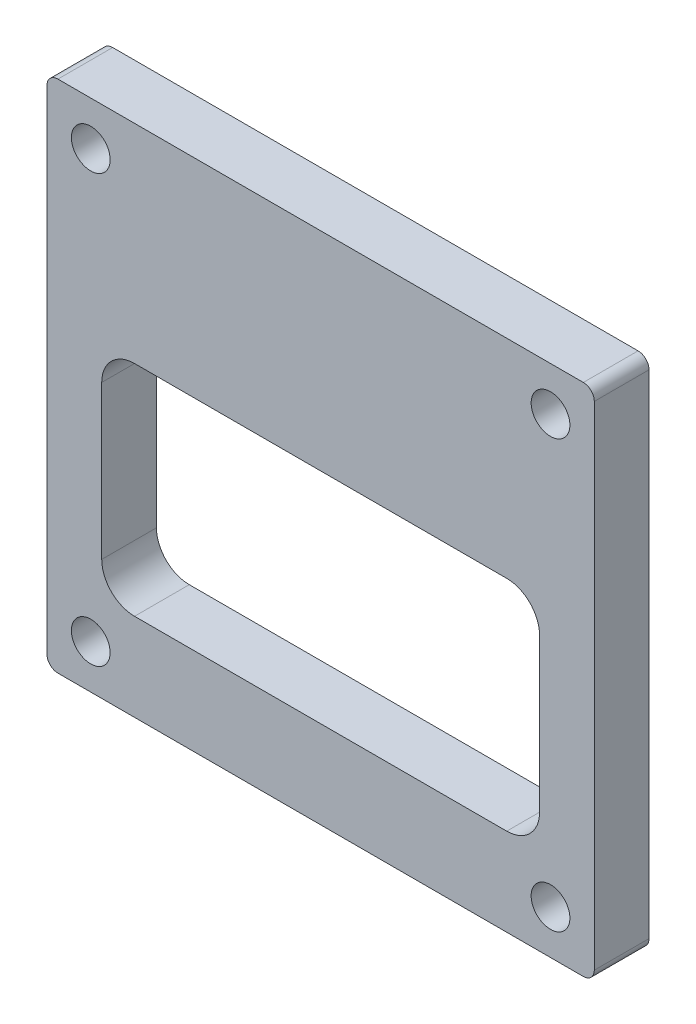
ISO-10303-21;
HEADER;
FILE_DESCRIPTION(('STEP AP214'),'2;1');
FILE_NAME('part.step','',(''),(''),'','','');
FILE_SCHEMA(('AUTOMOTIVE_DESIGN { 1 0 10303 214 1 1 1 1 }'));
ENDSEC;
DATA;
#1=APPLICATION_CONTEXT('core data for automotive mechanical design processes');
#2=APPLICATION_PROTOCOL_DEFINITION('international standard','automotive_design',2000,#1);
#3=PRODUCT_CONTEXT('',#1,'mechanical');
#4=PRODUCT('Part','Part','',(#3));
#5=PRODUCT_RELATED_PRODUCT_CATEGORY('part','',(#4));
#6=PRODUCT_DEFINITION_FORMATION('','',#4);
#7=PRODUCT_DEFINITION_CONTEXT('part definition',#1,'design');
#8=PRODUCT_DEFINITION('design','',#6,#7);
#9=PRODUCT_DEFINITION_SHAPE('','',#8);
#10=(LENGTH_UNIT() NAMED_UNIT(*) SI_UNIT(.MILLI.,.METRE.));
#11=(NAMED_UNIT(*) PLANE_ANGLE_UNIT() SI_UNIT($,.RADIAN.));
#12=(NAMED_UNIT(*) SI_UNIT($,.STERADIAN.) SOLID_ANGLE_UNIT());
#13=UNCERTAINTY_MEASURE_WITH_UNIT(LENGTH_MEASURE(1.E-05),#10,'distance_accuracy_value','');
#14=(GEOMETRIC_REPRESENTATION_CONTEXT(3) GLOBAL_UNCERTAINTY_ASSIGNED_CONTEXT((#13)) GLOBAL_UNIT_ASSIGNED_CONTEXT((#10,
#11,#12)) REPRESENTATION_CONTEXT('',''));
#15=CARTESIAN_POINT('',(0.,0.,0.));
#16=DIRECTION('',(0.,0.,1.));
#17=DIRECTION('',(1.,0.,0.));
#18=AXIS2_PLACEMENT_3D('',#15,#16,#17);
#19=CARTESIAN_POINT('',(0.,0.,6.35));
#20=DIRECTION('',(1.,0.,0.));
#21=DIRECTION('',(0.,0.,-1.));
#22=AXIS2_PLACEMENT_3D('',#19,#20,#21);
#23=PLANE('',#22);
#24=DIRECTION('',(0.,-1.,0.));
#25=VECTOR('',#24,1.);
#26=CARTESIAN_POINT('',(0.,0.,0.));
#27=LINE('',#26,#25);
#28=CARTESIAN_POINT('',(0.,58.42,0.));
#29=VERTEX_POINT('',#28);
#30=CARTESIAN_POINT('',(0.,1.27,0.));
#31=VERTEX_POINT('',#30);
#32=EDGE_CURVE('E174',#29,#31,#27,.T.);
#33=ORIENTED_EDGE('',*,*,#32,.T.);
#34=DIRECTION('',(0.,0.,-1.));
#35=VECTOR('',#34,1.);
#36=CARTESIAN_POINT('',(0.,1.27,6.35));
#37=LINE('',#36,#35);
#38=CARTESIAN_POINT('',(0.,1.27,6.35));
#39=VERTEX_POINT('',#38);
#40=EDGE_CURVE('E152',#31,#39,#37,.F.);
#41=ORIENTED_EDGE('',*,*,#40,.T.);
#42=DIRECTION('',(0.,-1.,0.));
#43=VECTOR('',#42,1.);
#44=CARTESIAN_POINT('',(0.,0.,6.35));
#45=LINE('',#44,#43);
#46=CARTESIAN_POINT('',(0.,58.42,6.35));
#47=VERTEX_POINT('',#46);
#48=EDGE_CURVE('E185',#47,#39,#45,.T.);
#49=ORIENTED_EDGE('',*,*,#48,.F.);
#50=DIRECTION('',(0.,0.,-1.));
#51=VECTOR('',#50,1.);
#52=CARTESIAN_POINT('',(0.,58.42,6.35));
#53=LINE('',#52,#51);
#54=EDGE_CURVE('E157',#47,#29,#53,.T.);
#55=ORIENTED_EDGE('',*,*,#54,.T.);
#56=EDGE_LOOP('',(#33,#41,#49,#55));
#57=FACE_BOUND('',#56,.T.);
#58=ADVANCED_FACE('F34',(#57),#23,.F.);
#59=CARTESIAN_POINT('',(0.,0.,6.35));
#60=DIRECTION('',(0.,1.,0.));
#61=DIRECTION('',(0.,0.,1.));
#62=AXIS2_PLACEMENT_3D('',#59,#60,#61);
#63=PLANE('',#62);
#64=DIRECTION('',(1.,0.,0.));
#65=VECTOR('',#64,1.);
#66=CARTESIAN_POINT('',(0.,0.,6.35));
#67=LINE('',#66,#65);
#68=CARTESIAN_POINT('',(1.27,0.,6.35));
#69=VERTEX_POINT('',#68);
#70=CARTESIAN_POINT('',(62.23,0.,6.35));
#71=VERTEX_POINT('',#70);
#72=EDGE_CURVE('E167',#69,#71,#67,.T.);
#73=ORIENTED_EDGE('',*,*,#72,.F.);
#74=DIRECTION('',(0.,0.,-1.));
#75=VECTOR('',#74,1.);
#76=CARTESIAN_POINT('',(1.27,0.,6.35));
#77=LINE('',#76,#75);
#78=CARTESIAN_POINT('',(1.27,0.,0.));
#79=VERTEX_POINT('',#78);
#80=EDGE_CURVE('E151',#69,#79,#77,.T.);
#81=ORIENTED_EDGE('',*,*,#80,.T.);
#82=DIRECTION('',(1.,0.,0.));
#83=VECTOR('',#82,1.);
#84=CARTESIAN_POINT('',(0.,0.,0.));
#85=LINE('',#84,#83);
#86=CARTESIAN_POINT('',(62.23,0.,0.));
#87=VERTEX_POINT('',#86);
#88=EDGE_CURVE('E164',#79,#87,#85,.T.);
#89=ORIENTED_EDGE('',*,*,#88,.T.);
#90=DIRECTION('',(0.,0.,-1.));
#91=VECTOR('',#90,1.);
#92=CARTESIAN_POINT('',(62.23,0.,6.35));
#93=LINE('',#92,#91);
#94=EDGE_CURVE('E169',#87,#71,#93,.F.);
#95=ORIENTED_EDGE('',*,*,#94,.T.);
#96=EDGE_LOOP('',(#73,#81,#89,#95));
#97=FACE_BOUND('',#96,.T.);
#98=ADVANCED_FACE('F163',(#97),#63,.F.);
#99=CARTESIAN_POINT('',(63.5,0.,6.35));
#100=DIRECTION('',(-1.,0.,0.));
#101=DIRECTION('',(0.,0.,1.));
#102=AXIS2_PLACEMENT_3D('',#99,#100,#101);
#103=PLANE('',#102);
#104=DIRECTION('',(0.,1.,0.));
#105=VECTOR('',#104,1.);
#106=CARTESIAN_POINT('',(63.5,0.,6.35));
#107=LINE('',#106,#105);
#108=CARTESIAN_POINT('',(63.5,1.27,6.35));
#109=VERTEX_POINT('',#108);
#110=CARTESIAN_POINT('',(63.5,58.42,6.35));
#111=VERTEX_POINT('',#110);
#112=EDGE_CURVE('E306',#109,#111,#107,.T.);
#113=ORIENTED_EDGE('',*,*,#112,.F.);
#114=DIRECTION('',(0.,0.,-1.));
#115=VECTOR('',#114,1.);
#116=CARTESIAN_POINT('',(63.5,1.27,6.35));
#117=LINE('',#116,#115);
#118=CARTESIAN_POINT('',(63.5,1.27,0.));
#119=VERTEX_POINT('',#118);
#120=EDGE_CURVE('E205',#109,#119,#117,.T.);
#121=ORIENTED_EDGE('',*,*,#120,.T.);
#122=DIRECTION('',(0.,1.,0.));
#123=VECTOR('',#122,1.);
#124=CARTESIAN_POINT('',(63.5,0.,0.));
#125=LINE('',#124,#123);
#126=CARTESIAN_POINT('',(63.5,58.42,0.));
#127=VERTEX_POINT('',#126);
#128=EDGE_CURVE('E173',#119,#127,#125,.T.);
#129=ORIENTED_EDGE('',*,*,#128,.T.);
#130=DIRECTION('',(0.,0.,-1.));
#131=VECTOR('',#130,1.);
#132=CARTESIAN_POINT('',(63.5,58.42,6.35));
#133=LINE('',#132,#131);
#134=EDGE_CURVE('E203',#127,#111,#133,.F.);
#135=ORIENTED_EDGE('',*,*,#134,.T.);
#136=EDGE_LOOP('',(#113,#121,#129,#135));
#137=FACE_BOUND('',#136,.T.);
#138=ADVANCED_FACE('F328',(#137),#103,.F.);
#139=CARTESIAN_POINT('',(0.,59.69,6.35));
#140=DIRECTION('',(0.,-1.,0.));
#141=DIRECTION('',(0.,0.,-1.));
#142=AXIS2_PLACEMENT_3D('',#139,#140,#141);
#143=PLANE('',#142);
#144=DIRECTION('',(-1.,0.,0.));
#145=VECTOR('',#144,1.);
#146=CARTESIAN_POINT('',(0.,59.69,6.35));
#147=LINE('',#146,#145);
#148=CARTESIAN_POINT('',(62.23,59.69,6.35));
#149=VERTEX_POINT('',#148);
#150=CARTESIAN_POINT('',(1.27,59.69,6.35));
#151=VERTEX_POINT('',#150);
#152=EDGE_CURVE('E186',#149,#151,#147,.T.);
#153=ORIENTED_EDGE('',*,*,#152,.F.);
#154=DIRECTION('',(0.,0.,-1.));
#155=VECTOR('',#154,1.);
#156=CARTESIAN_POINT('',(62.23,59.69,6.35));
#157=LINE('',#156,#155);
#158=CARTESIAN_POINT('',(62.23,59.69,0.));
#159=VERTEX_POINT('',#158);
#160=EDGE_CURVE('E210',#149,#159,#157,.T.);
#161=ORIENTED_EDGE('',*,*,#160,.T.);
#162=DIRECTION('',(-1.,0.,0.));
#163=VECTOR('',#162,1.);
#164=CARTESIAN_POINT('',(0.,59.69,0.));
#165=LINE('',#164,#163);
#166=CARTESIAN_POINT('',(1.27,59.69,0.));
#167=VERTEX_POINT('',#166);
#168=EDGE_CURVE('E177',#159,#167,#165,.T.);
#169=ORIENTED_EDGE('',*,*,#168,.T.);
#170=DIRECTION('',(0.,0.,-1.));
#171=VECTOR('',#170,1.);
#172=CARTESIAN_POINT('',(1.27,59.69,6.35));
#173=LINE('',#172,#171);
#174=EDGE_CURVE('E208',#167,#151,#173,.F.);
#175=ORIENTED_EDGE('',*,*,#174,.T.);
#176=EDGE_LOOP('',(#153,#161,#169,#175));
#177=FACE_BOUND('',#176,.T.);
#178=ADVANCED_FACE('F322',(#177),#143,.F.);
#179=CARTESIAN_POINT('',(0.,0.,6.35));
#180=DIRECTION('',(0.,0.,-1.));
#181=DIRECTION('',(-1.,0.,0.));
#182=AXIS2_PLACEMENT_3D('',#179,#180,#181);
#183=PLANE('',#182);
#184=DIRECTION('',(1.,0.,0.));
#185=VECTOR('',#184,1.);
#186=CARTESIAN_POINT('',(6.35,10.16,6.35));
#187=LINE('',#186,#185);
#188=CARTESIAN_POINT('',(10.16,10.16,6.35));
#189=VERTEX_POINT('',#188);
#190=CARTESIAN_POINT('',(53.34,10.16,6.35));
#191=VERTEX_POINT('',#190);
#192=EDGE_CURVE('E276',#189,#191,#187,.T.);
#193=ORIENTED_EDGE('',*,*,#192,.F.);
#194=CARTESIAN_POINT('',(10.16,13.97,6.35));
#195=DIRECTION('',(0.,0.,-1.));
#196=DIRECTION('',(-1.,0.,0.));
#197=AXIS2_PLACEMENT_3D('',#194,#195,#196);
#198=CIRCLE('',#197,3.81);
#199=CARTESIAN_POINT('',(6.35,13.97,6.35));
#200=VERTEX_POINT('',#199);
#201=EDGE_CURVE('E240',#189,#200,#198,.T.);
#202=ORIENTED_EDGE('',*,*,#201,.T.);
#203=DIRECTION('',(0.,-1.,0.));
#204=VECTOR('',#203,1.);
#205=CARTESIAN_POINT('',(6.35,35.56,6.35));
#206=LINE('',#205,#204);
#207=CARTESIAN_POINT('',(6.35,31.75,6.35));
#208=VERTEX_POINT('',#207);
#209=EDGE_CURVE('E251',#208,#200,#206,.T.);
#210=ORIENTED_EDGE('',*,*,#209,.F.);
#211=CARTESIAN_POINT('',(10.16,31.75,6.35));
#212=DIRECTION('',(0.,0.,-1.));
#213=DIRECTION('',(-1.,0.,0.));
#214=AXIS2_PLACEMENT_3D('',#211,#212,#213);
#215=CIRCLE('',#214,3.81);
#216=CARTESIAN_POINT('',(10.16,35.56,6.35));
#217=VERTEX_POINT('',#216);
#218=EDGE_CURVE('E42',#208,#217,#215,.T.);
#219=ORIENTED_EDGE('',*,*,#218,.T.);
#220=DIRECTION('',(-1.,0.,0.));
#221=VECTOR('',#220,1.);
#222=CARTESIAN_POINT('',(6.35,35.56,6.35));
#223=LINE('',#222,#221);
#224=CARTESIAN_POINT('',(53.34,35.56,6.35));
#225=VERTEX_POINT('',#224);
#226=EDGE_CURVE('E250',#225,#217,#223,.T.);
#227=ORIENTED_EDGE('',*,*,#226,.F.);
#228=CARTESIAN_POINT('',(53.34,31.75,6.35));
#229=DIRECTION('',(0.,0.,-1.));
#230=DIRECTION('',(-1.,0.,0.));
#231=AXIS2_PLACEMENT_3D('',#228,#229,#230);
#232=CIRCLE('',#231,3.81);
#233=CARTESIAN_POINT('',(57.15,31.75,6.35));
#234=VERTEX_POINT('',#233);
#235=EDGE_CURVE('E232',#225,#234,#232,.T.);
#236=ORIENTED_EDGE('',*,*,#235,.T.);
#237=DIRECTION('',(0.,1.,0.));
#238=VECTOR('',#237,1.);
#239=CARTESIAN_POINT('',(57.15,35.56,6.35));
#240=LINE('',#239,#238);
#241=CARTESIAN_POINT('',(57.15,13.97,6.35));
#242=VERTEX_POINT('',#241);
#243=EDGE_CURVE('E260',#242,#234,#240,.T.);
#244=ORIENTED_EDGE('',*,*,#243,.F.);
#245=CARTESIAN_POINT('',(53.34,13.97,6.35));
#246=DIRECTION('',(0.,0.,-1.));
#247=DIRECTION('',(-1.,0.,0.));
#248=AXIS2_PLACEMENT_3D('',#245,#246,#247);
#249=CIRCLE('',#248,3.81);
#250=EDGE_CURVE('E236',#242,#191,#249,.T.);
#251=ORIENTED_EDGE('',*,*,#250,.T.);
#252=EDGE_LOOP('',(#193,#202,#210,#219,#227,#236,#244,#251));
#253=FACE_BOUND('',#252,.T.);
#254=CARTESIAN_POINT('',(5.08,54.61,6.35));
#255=DIRECTION('',(0.,0.,1.));
#256=DIRECTION('',(1.,0.,0.));
#257=AXIS2_PLACEMENT_3D('',#254,#255,#256);
#258=CIRCLE('',#257,2.24789999999999);
#259=CARTESIAN_POINT('',(7.32789999999999,54.61,6.35));
#260=VERTEX_POINT('',#259);
#261=EDGE_CURVE('E274',#260,#260,#258,.T.);
#262=ORIENTED_EDGE('',*,*,#261,.F.);
#263=EDGE_LOOP('',(#262));
#264=FACE_BOUND('',#263,.T.);
#265=CARTESIAN_POINT('',(58.42,54.61,6.35));
#266=DIRECTION('',(0.,0.,1.));
#267=DIRECTION('',(1.,0.,0.));
#268=AXIS2_PLACEMENT_3D('',#265,#266,#267);
#269=CIRCLE('',#268,2.24789999999998);
#270=CARTESIAN_POINT('',(60.6679,54.61,6.35));
#271=VERTEX_POINT('',#270);
#272=EDGE_CURVE('E286',#271,#271,#269,.T.);
#273=ORIENTED_EDGE('',*,*,#272,.F.);
#274=EDGE_LOOP('',(#273));
#275=FACE_BOUND('',#274,.T.);
#276=CARTESIAN_POINT('',(58.42,5.08,6.35));
#277=DIRECTION('',(0.,0.,1.));
#278=DIRECTION('',(1.,0.,0.));
#279=AXIS2_PLACEMENT_3D('',#276,#277,#278);
#280=CIRCLE('',#279,2.24789999999998);
#281=CARTESIAN_POINT('',(60.6679,5.08,6.35));
#282=VERTEX_POINT('',#281);
#283=EDGE_CURVE('E292',#282,#282,#280,.T.);
#284=ORIENTED_EDGE('',*,*,#283,.F.);
#285=EDGE_LOOP('',(#284));
#286=FACE_BOUND('',#285,.T.);
#287=CARTESIAN_POINT('',(5.08,5.08,6.35));
#288=DIRECTION('',(0.,0.,1.));
#289=DIRECTION('',(1.,0.,0.));
#290=AXIS2_PLACEMENT_3D('',#287,#288,#289);
#291=CIRCLE('',#290,2.24789999999999);
#292=CARTESIAN_POINT('',(7.32789999999999,5.08,6.35));
#293=VERTEX_POINT('',#292);
#294=EDGE_CURVE('E298',#293,#293,#291,.T.);
#295=ORIENTED_EDGE('',*,*,#294,.F.);
#296=EDGE_LOOP('',(#295));
#297=FACE_BOUND('',#296,.T.);
#298=ORIENTED_EDGE('',*,*,#48,.T.);
#299=CARTESIAN_POINT('',(1.27,1.27,6.35));
#300=DIRECTION('',(0.,0.,-1.));
#301=DIRECTION('',(-1.,0.,0.));
#302=AXIS2_PLACEMENT_3D('',#299,#300,#301);
#303=CIRCLE('',#302,1.27);
#304=EDGE_CURVE('E201',#39,#69,#303,.F.);
#305=ORIENTED_EDGE('',*,*,#304,.T.);
#306=ORIENTED_EDGE('',*,*,#72,.T.);
#307=CARTESIAN_POINT('',(62.23,1.27,6.35));
#308=DIRECTION('',(0.,0.,-1.));
#309=DIRECTION('',(-1.,0.,0.));
#310=AXIS2_PLACEMENT_3D('',#307,#308,#309);
#311=CIRCLE('',#310,1.27);
#312=EDGE_CURVE('E199',#71,#109,#311,.F.);
#313=ORIENTED_EDGE('',*,*,#312,.T.);
#314=ORIENTED_EDGE('',*,*,#112,.T.);
#315=CARTESIAN_POINT('',(62.23,58.42,6.35));
#316=DIRECTION('',(0.,0.,-1.));
#317=DIRECTION('',(-1.,0.,0.));
#318=AXIS2_PLACEMENT_3D('',#315,#316,#317);
#319=CIRCLE('',#318,1.27);
#320=EDGE_CURVE('E197',#111,#149,#319,.F.);
#321=ORIENTED_EDGE('',*,*,#320,.T.);
#322=ORIENTED_EDGE('',*,*,#152,.T.);
#323=CARTESIAN_POINT('',(1.27,58.42,6.35));
#324=DIRECTION('',(0.,0.,-1.));
#325=DIRECTION('',(-1.,0.,0.));
#326=AXIS2_PLACEMENT_3D('',#323,#324,#325);
#327=CIRCLE('',#326,1.27);
#328=EDGE_CURVE('E195',#151,#47,#327,.F.);
#329=ORIENTED_EDGE('',*,*,#328,.T.);
#330=EDGE_LOOP('',(#298,#305,#306,#313,#314,#321,#322,#329));
#331=FACE_BOUND('',#330,.T.);
#332=ADVANCED_FACE('F248',(#253,#264,#275,#286,#297,#331),#183,.F.);
#333=CARTESIAN_POINT('',(0.,0.,0.));
#334=DIRECTION('',(0.,0.,-1.));
#335=DIRECTION('',(-1.,0.,0.));
#336=AXIS2_PLACEMENT_3D('',#333,#334,#335);
#337=PLANE('',#336);
#338=DIRECTION('',(-1.,0.,0.));
#339=VECTOR('',#338,1.);
#340=CARTESIAN_POINT('',(6.35,35.56,0.));
#341=LINE('',#340,#339);
#342=CARTESIAN_POINT('',(53.34,35.56,0.));
#343=VERTEX_POINT('',#342);
#344=CARTESIAN_POINT('',(10.16,35.56,0.));
#345=VERTEX_POINT('',#344);
#346=EDGE_CURVE('E272',#343,#345,#341,.T.);
#347=ORIENTED_EDGE('',*,*,#346,.T.);
#348=CARTESIAN_POINT('',(10.16,31.75,0.));
#349=DIRECTION('',(0.,0.,-1.));
#350=DIRECTION('',(-1.,0.,0.));
#351=AXIS2_PLACEMENT_3D('',#348,#349,#350);
#352=CIRCLE('',#351,3.81);
#353=CARTESIAN_POINT('',(6.35,31.75,0.));
#354=VERTEX_POINT('',#353);
#355=EDGE_CURVE('E11',#345,#354,#352,.F.);
#356=ORIENTED_EDGE('',*,*,#355,.T.);
#357=DIRECTION('',(0.,-1.,0.));
#358=VECTOR('',#357,1.);
#359=CARTESIAN_POINT('',(6.35,35.56,0.));
#360=LINE('',#359,#358);
#361=CARTESIAN_POINT('',(6.35,13.97,0.));
#362=VERTEX_POINT('',#361);
#363=EDGE_CURVE('E259',#354,#362,#360,.T.);
#364=ORIENTED_EDGE('',*,*,#363,.T.);
#365=CARTESIAN_POINT('',(10.16,13.97,0.));
#366=DIRECTION('',(0.,0.,-1.));
#367=DIRECTION('',(-1.,0.,0.));
#368=AXIS2_PLACEMENT_3D('',#365,#366,#367);
#369=CIRCLE('',#368,3.81);
#370=CARTESIAN_POINT('',(10.16,10.16,0.));
#371=VERTEX_POINT('',#370);
#372=EDGE_CURVE('E242',#362,#371,#369,.F.);
#373=ORIENTED_EDGE('',*,*,#372,.T.);
#374=DIRECTION('',(1.,0.,0.));
#375=VECTOR('',#374,1.);
#376=CARTESIAN_POINT('',(6.35,10.16,0.));
#377=LINE('',#376,#375);
#378=CARTESIAN_POINT('',(53.34,10.16,0.));
#379=VERTEX_POINT('',#378);
#380=EDGE_CURVE('E264',#371,#379,#377,.T.);
#381=ORIENTED_EDGE('',*,*,#380,.T.);
#382=CARTESIAN_POINT('',(53.34,13.97,0.));
#383=DIRECTION('',(0.,0.,-1.));
#384=DIRECTION('',(-1.,0.,0.));
#385=AXIS2_PLACEMENT_3D('',#382,#383,#384);
#386=CIRCLE('',#385,3.81);
#387=CARTESIAN_POINT('',(57.15,13.97,0.));
#388=VERTEX_POINT('',#387);
#389=EDGE_CURVE('E238',#379,#388,#386,.F.);
#390=ORIENTED_EDGE('',*,*,#389,.T.);
#391=DIRECTION('',(0.,1.,0.));
#392=VECTOR('',#391,1.);
#393=CARTESIAN_POINT('',(57.15,35.56,0.));
#394=LINE('',#393,#392);
#395=CARTESIAN_POINT('',(57.15,31.75,0.));
#396=VERTEX_POINT('',#395);
#397=EDGE_CURVE('E267',#388,#396,#394,.T.);
#398=ORIENTED_EDGE('',*,*,#397,.T.);
#399=CARTESIAN_POINT('',(53.34,31.75,0.));
#400=DIRECTION('',(0.,0.,-1.));
#401=DIRECTION('',(-1.,0.,0.));
#402=AXIS2_PLACEMENT_3D('',#399,#400,#401);
#403=CIRCLE('',#402,3.81);
#404=EDGE_CURVE('E234',#396,#343,#403,.F.);
#405=ORIENTED_EDGE('',*,*,#404,.T.);
#406=EDGE_LOOP('',(#347,#356,#364,#373,#381,#390,#398,#405));
#407=FACE_BOUND('',#406,.T.);
#408=CARTESIAN_POINT('',(5.08,54.61,0.));
#409=DIRECTION('',(0.,0.,1.));
#410=DIRECTION('',(1.,0.,0.));
#411=AXIS2_PLACEMENT_3D('',#408,#409,#410);
#412=CIRCLE('',#411,2.2479);
#413=CARTESIAN_POINT('',(7.3279,54.61,0.));
#414=VERTEX_POINT('',#413);
#415=EDGE_CURVE('E283',#414,#414,#412,.T.);
#416=ORIENTED_EDGE('',*,*,#415,.T.);
#417=EDGE_LOOP('',(#416));
#418=FACE_BOUND('',#417,.T.);
#419=CARTESIAN_POINT('',(58.42,54.61,0.));
#420=DIRECTION('',(0.,0.,1.));
#421=DIRECTION('',(1.,0.,0.));
#422=AXIS2_PLACEMENT_3D('',#419,#420,#421);
#423=CIRCLE('',#422,2.2479);
#424=CARTESIAN_POINT('',(60.6679,54.61,0.));
#425=VERTEX_POINT('',#424);
#426=EDGE_CURVE('E289',#425,#425,#423,.T.);
#427=ORIENTED_EDGE('',*,*,#426,.T.);
#428=EDGE_LOOP('',(#427));
#429=FACE_BOUND('',#428,.T.);
#430=CARTESIAN_POINT('',(58.42,5.08,0.));
#431=DIRECTION('',(0.,0.,1.));
#432=DIRECTION('',(1.,0.,0.));
#433=AXIS2_PLACEMENT_3D('',#430,#431,#432);
#434=CIRCLE('',#433,2.2479);
#435=CARTESIAN_POINT('',(60.6679,5.08,0.));
#436=VERTEX_POINT('',#435);
#437=EDGE_CURVE('E295',#436,#436,#434,.T.);
#438=ORIENTED_EDGE('',*,*,#437,.T.);
#439=EDGE_LOOP('',(#438));
#440=FACE_BOUND('',#439,.T.);
#441=CARTESIAN_POINT('',(5.08,5.08,0.));
#442=DIRECTION('',(0.,0.,1.));
#443=DIRECTION('',(1.,0.,0.));
#444=AXIS2_PLACEMENT_3D('',#441,#442,#443);
#445=CIRCLE('',#444,2.2479);
#446=CARTESIAN_POINT('',(7.3279,5.08,0.));
#447=VERTEX_POINT('',#446);
#448=EDGE_CURVE('E179',#447,#447,#445,.T.);
#449=ORIENTED_EDGE('',*,*,#448,.T.);
#450=EDGE_LOOP('',(#449));
#451=FACE_BOUND('',#450,.T.);
#452=ORIENTED_EDGE('',*,*,#88,.F.);
#453=CARTESIAN_POINT('',(1.27,1.27,0.));
#454=DIRECTION('',(0.,0.,-1.));
#455=DIRECTION('',(-1.,0.,0.));
#456=AXIS2_PLACEMENT_3D('',#453,#454,#455);
#457=CIRCLE('',#456,1.27);
#458=EDGE_CURVE('E147',#79,#31,#457,.T.);
#459=ORIENTED_EDGE('',*,*,#458,.T.);
#460=ORIENTED_EDGE('',*,*,#32,.F.);
#461=CARTESIAN_POINT('',(1.27,58.42,0.));
#462=DIRECTION('',(0.,0.,-1.));
#463=DIRECTION('',(-1.,0.,0.));
#464=AXIS2_PLACEMENT_3D('',#461,#462,#463);
#465=CIRCLE('',#464,1.27);
#466=EDGE_CURVE('E168',#29,#167,#465,.T.);
#467=ORIENTED_EDGE('',*,*,#466,.T.);
#468=ORIENTED_EDGE('',*,*,#168,.F.);
#469=CARTESIAN_POINT('',(62.23,58.42,0.));
#470=DIRECTION('',(0.,0.,-1.));
#471=DIRECTION('',(-1.,0.,0.));
#472=AXIS2_PLACEMENT_3D('',#469,#470,#471);
#473=CIRCLE('',#472,1.27);
#474=EDGE_CURVE('E189',#159,#127,#473,.T.);
#475=ORIENTED_EDGE('',*,*,#474,.T.);
#476=ORIENTED_EDGE('',*,*,#128,.F.);
#477=CARTESIAN_POINT('',(62.23,1.27,0.));
#478=DIRECTION('',(0.,0.,-1.));
#479=DIRECTION('',(-1.,0.,0.));
#480=AXIS2_PLACEMENT_3D('',#477,#478,#479);
#481=CIRCLE('',#480,1.27);
#482=EDGE_CURVE('E158',#119,#87,#481,.T.);
#483=ORIENTED_EDGE('',*,*,#482,.T.);
#484=EDGE_LOOP('',(#452,#459,#460,#467,#468,#475,#476,#483));
#485=FACE_BOUND('',#484,.T.);
#486=ADVANCED_FACE('F171',(#407,#418,#429,#440,#451,#485),#337,.T.);
#487=CARTESIAN_POINT('',(1.27,1.27,6.35));
#488=DIRECTION('',(0.,0.,-1.));
#489=DIRECTION('',(-1.,0.,0.));
#490=AXIS2_PLACEMENT_3D('',#487,#488,#489);
#491=CYLINDRICAL_SURFACE('',#490,1.27);
#492=ORIENTED_EDGE('',*,*,#304,.F.);
#493=ORIENTED_EDGE('',*,*,#40,.F.);
#494=ORIENTED_EDGE('',*,*,#458,.F.);
#495=ORIENTED_EDGE('',*,*,#80,.F.);
#496=EDGE_LOOP('',(#492,#493,#494,#495));
#497=FACE_BOUND('',#496,.T.);
#498=ADVANCED_FACE('F150',(#497),#491,.T.);
#499=CARTESIAN_POINT('',(62.23,1.27,6.35));
#500=DIRECTION('',(0.,0.,-1.));
#501=DIRECTION('',(-1.,0.,0.));
#502=AXIS2_PLACEMENT_3D('',#499,#500,#501);
#503=CYLINDRICAL_SURFACE('',#502,1.27);
#504=ORIENTED_EDGE('',*,*,#312,.F.);
#505=ORIENTED_EDGE('',*,*,#94,.F.);
#506=ORIENTED_EDGE('',*,*,#482,.F.);
#507=ORIENTED_EDGE('',*,*,#120,.F.);
#508=EDGE_LOOP('',(#504,#505,#506,#507));
#509=FACE_BOUND('',#508,.T.);
#510=ADVANCED_FACE('F332',(#509),#503,.T.);
#511=CARTESIAN_POINT('',(62.23,58.42,6.35));
#512=DIRECTION('',(0.,0.,-1.));
#513=DIRECTION('',(-1.,0.,0.));
#514=AXIS2_PLACEMENT_3D('',#511,#512,#513);
#515=CYLINDRICAL_SURFACE('',#514,1.27);
#516=ORIENTED_EDGE('',*,*,#320,.F.);
#517=ORIENTED_EDGE('',*,*,#134,.F.);
#518=ORIENTED_EDGE('',*,*,#474,.F.);
#519=ORIENTED_EDGE('',*,*,#160,.F.);
#520=EDGE_LOOP('',(#516,#517,#518,#519));
#521=FACE_BOUND('',#520,.T.);
#522=ADVANCED_FACE('F324',(#521),#515,.T.);
#523=CARTESIAN_POINT('',(1.27,58.42,6.35));
#524=DIRECTION('',(0.,0.,-1.));
#525=DIRECTION('',(-1.,0.,0.));
#526=AXIS2_PLACEMENT_3D('',#523,#524,#525);
#527=CYLINDRICAL_SURFACE('',#526,1.27);
#528=ORIENTED_EDGE('',*,*,#328,.F.);
#529=ORIENTED_EDGE('',*,*,#174,.F.);
#530=ORIENTED_EDGE('',*,*,#466,.F.);
#531=ORIENTED_EDGE('',*,*,#54,.F.);
#532=EDGE_LOOP('',(#528,#529,#530,#531));
#533=FACE_BOUND('',#532,.T.);
#534=ADVANCED_FACE('F319',(#533),#527,.T.);
#535=CARTESIAN_POINT('',(5.08,5.08,6.35));
#536=DIRECTION('',(0.,0.,1.));
#537=DIRECTION('',(1.,0.,0.));
#538=AXIS2_PLACEMENT_3D('',#535,#536,#537);
#539=CYLINDRICAL_SURFACE('',#538,2.24789999999999);
#540=ORIENTED_EDGE('',*,*,#448,.F.);
#541=EDGE_LOOP('',(#540));
#542=FACE_BOUND('',#541,.T.);
#543=ORIENTED_EDGE('',*,*,#294,.T.);
#544=EDGE_LOOP('',(#543));
#545=FACE_BOUND('',#544,.T.);
#546=ADVANCED_FACE('F356',(#542,#545),#539,.F.);
#547=CARTESIAN_POINT('',(58.42,5.08,6.35));
#548=DIRECTION('',(0.,0.,1.));
#549=DIRECTION('',(1.,0.,0.));
#550=AXIS2_PLACEMENT_3D('',#547,#548,#549);
#551=CYLINDRICAL_SURFACE('',#550,2.24789999999999);
#552=ORIENTED_EDGE('',*,*,#437,.F.);
#553=EDGE_LOOP('',(#552));
#554=FACE_BOUND('',#553,.T.);
#555=ORIENTED_EDGE('',*,*,#283,.T.);
#556=EDGE_LOOP('',(#555));
#557=FACE_BOUND('',#556,.T.);
#558=ADVANCED_FACE('F359',(#554,#557),#551,.F.);
#559=CARTESIAN_POINT('',(58.42,54.61,6.35));
#560=DIRECTION('',(0.,0.,1.));
#561=DIRECTION('',(1.,0.,0.));
#562=AXIS2_PLACEMENT_3D('',#559,#560,#561);
#563=CYLINDRICAL_SURFACE('',#562,2.24789999999999);
#564=ORIENTED_EDGE('',*,*,#426,.F.);
#565=EDGE_LOOP('',(#564));
#566=FACE_BOUND('',#565,.T.);
#567=ORIENTED_EDGE('',*,*,#272,.T.);
#568=EDGE_LOOP('',(#567));
#569=FACE_BOUND('',#568,.T.);
#570=ADVANCED_FACE('F363',(#566,#569),#563,.F.);
#571=CARTESIAN_POINT('',(5.08,54.61,6.35));
#572=DIRECTION('',(0.,0.,1.));
#573=DIRECTION('',(1.,0.,0.));
#574=AXIS2_PLACEMENT_3D('',#571,#572,#573);
#575=CYLINDRICAL_SURFACE('',#574,2.24789999999999);
#576=ORIENTED_EDGE('',*,*,#415,.F.);
#577=EDGE_LOOP('',(#576));
#578=FACE_BOUND('',#577,.T.);
#579=ORIENTED_EDGE('',*,*,#261,.T.);
#580=EDGE_LOOP('',(#579));
#581=FACE_BOUND('',#580,.T.);
#582=ADVANCED_FACE('F367',(#578,#581),#575,.F.);
#583=CARTESIAN_POINT('',(6.35,35.56,0.));
#584=DIRECTION('',(-1.,0.,0.));
#585=DIRECTION('',(0.,-1.,0.));
#586=AXIS2_PLACEMENT_3D('',#583,#584,#585);
#587=PLANE('',#586);
#588=ORIENTED_EDGE('',*,*,#209,.T.);
#589=DIRECTION('',(0.,0.,1.));
#590=VECTOR('',#589,1.);
#591=CARTESIAN_POINT('',(6.35,13.97,0.));
#592=LINE('',#591,#590);
#593=EDGE_CURVE('E49',#200,#362,#592,.F.);
#594=ORIENTED_EDGE('',*,*,#593,.T.);
#595=ORIENTED_EDGE('',*,*,#363,.F.);
#596=DIRECTION('',(0.,0.,1.));
#597=VECTOR('',#596,1.);
#598=CARTESIAN_POINT('',(6.35,31.75,6.35));
#599=LINE('',#598,#597);
#600=EDGE_CURVE('E228',#354,#208,#599,.T.);
#601=ORIENTED_EDGE('',*,*,#600,.T.);
#602=EDGE_LOOP('',(#588,#594,#595,#601));
#603=FACE_BOUND('',#602,.T.);
#604=ADVANCED_FACE('F262',(#603),#587,.F.);
#605=CARTESIAN_POINT('',(6.35,35.56,0.));
#606=DIRECTION('',(0.,1.,0.));
#607=DIRECTION('',(0.,0.,1.));
#608=AXIS2_PLACEMENT_3D('',#605,#606,#607);
#609=PLANE('',#608);
#610=ORIENTED_EDGE('',*,*,#346,.F.);
#611=DIRECTION('',(0.,0.,1.));
#612=VECTOR('',#611,1.);
#613=CARTESIAN_POINT('',(53.34,35.56,6.35));
#614=LINE('',#613,#612);
#615=EDGE_CURVE('E215',#343,#225,#614,.T.);
#616=ORIENTED_EDGE('',*,*,#615,.T.);
#617=ORIENTED_EDGE('',*,*,#226,.T.);
#618=DIRECTION('',(0.,0.,1.));
#619=VECTOR('',#618,1.);
#620=CARTESIAN_POINT('',(10.16,35.56,0.));
#621=LINE('',#620,#619);
#622=EDGE_CURVE('E213',#217,#345,#621,.F.);
#623=ORIENTED_EDGE('',*,*,#622,.T.);
#624=EDGE_LOOP('',(#610,#616,#617,#623));
#625=FACE_BOUND('',#624,.T.);
#626=ADVANCED_FACE('F257',(#625),#609,.F.);
#627=CARTESIAN_POINT('',(57.15,35.56,0.));
#628=DIRECTION('',(1.,0.,0.));
#629=DIRECTION('',(0.,1.,0.));
#630=AXIS2_PLACEMENT_3D('',#627,#628,#629);
#631=PLANE('',#630);
#632=ORIENTED_EDGE('',*,*,#243,.T.);
#633=DIRECTION('',(0.,0.,1.));
#634=VECTOR('',#633,1.);
#635=CARTESIAN_POINT('',(57.15,31.75,0.));
#636=LINE('',#635,#634);
#637=EDGE_CURVE('E221',#234,#396,#636,.F.);
#638=ORIENTED_EDGE('',*,*,#637,.T.);
#639=ORIENTED_EDGE('',*,*,#397,.F.);
#640=DIRECTION('',(0.,0.,1.));
#641=VECTOR('',#640,1.);
#642=CARTESIAN_POINT('',(57.15,13.97,6.35));
#643=LINE('',#642,#641);
#644=EDGE_CURVE('E218',#388,#242,#643,.T.);
#645=ORIENTED_EDGE('',*,*,#644,.T.);
#646=EDGE_LOOP('',(#632,#638,#639,#645));
#647=FACE_BOUND('',#646,.T.);
#648=ADVANCED_FACE('F378',(#647),#631,.F.);
#649=CARTESIAN_POINT('',(6.35,10.16,0.));
#650=DIRECTION('',(0.,-1.,0.));
#651=DIRECTION('',(0.,0.,-1.));
#652=AXIS2_PLACEMENT_3D('',#649,#650,#651);
#653=PLANE('',#652);
#654=ORIENTED_EDGE('',*,*,#192,.T.);
#655=DIRECTION('',(0.,0.,1.));
#656=VECTOR('',#655,1.);
#657=CARTESIAN_POINT('',(53.34,10.16,0.));
#658=LINE('',#657,#656);
#659=EDGE_CURVE('E226',#191,#379,#658,.F.);
#660=ORIENTED_EDGE('',*,*,#659,.T.);
#661=ORIENTED_EDGE('',*,*,#380,.F.);
#662=DIRECTION('',(0.,0.,1.));
#663=VECTOR('',#662,1.);
#664=CARTESIAN_POINT('',(10.16,10.16,6.35));
#665=LINE('',#664,#663);
#666=EDGE_CURVE('E223',#371,#189,#665,.T.);
#667=ORIENTED_EDGE('',*,*,#666,.T.);
#668=EDGE_LOOP('',(#654,#660,#661,#667));
#669=FACE_BOUND('',#668,.T.);
#670=ADVANCED_FACE('F374',(#669),#653,.F.);
#671=CARTESIAN_POINT('',(53.34,31.75,0.));
#672=DIRECTION('',(0.,0.,-1.));
#673=DIRECTION('',(-1.,0.,0.));
#674=AXIS2_PLACEMENT_3D('',#671,#672,#673);
#675=CYLINDRICAL_SURFACE('',#674,3.81);
#676=ORIENTED_EDGE('',*,*,#404,.F.);
#677=ORIENTED_EDGE('',*,*,#637,.F.);
#678=ORIENTED_EDGE('',*,*,#235,.F.);
#679=ORIENTED_EDGE('',*,*,#615,.F.);
#680=EDGE_LOOP('',(#676,#677,#678,#679));
#681=FACE_BOUND('',#680,.T.);
#682=ADVANCED_FACE('F377',(#681),#675,.F.);
#683=CARTESIAN_POINT('',(53.34,13.97,0.));
#684=DIRECTION('',(0.,0.,-1.));
#685=DIRECTION('',(-1.,0.,0.));
#686=AXIS2_PLACEMENT_3D('',#683,#684,#685);
#687=CYLINDRICAL_SURFACE('',#686,3.81);
#688=ORIENTED_EDGE('',*,*,#389,.F.);
#689=ORIENTED_EDGE('',*,*,#659,.F.);
#690=ORIENTED_EDGE('',*,*,#250,.F.);
#691=ORIENTED_EDGE('',*,*,#644,.F.);
#692=EDGE_LOOP('',(#688,#689,#690,#691));
#693=FACE_BOUND('',#692,.T.);
#694=ADVANCED_FACE('F402',(#693),#687,.F.);
#695=CARTESIAN_POINT('',(10.16,13.97,0.));
#696=DIRECTION('',(0.,0.,-1.));
#697=DIRECTION('',(-1.,0.,0.));
#698=AXIS2_PLACEMENT_3D('',#695,#696,#697);
#699=CYLINDRICAL_SURFACE('',#698,3.81);
#700=ORIENTED_EDGE('',*,*,#372,.F.);
#701=ORIENTED_EDGE('',*,*,#593,.F.);
#702=ORIENTED_EDGE('',*,*,#201,.F.);
#703=ORIENTED_EDGE('',*,*,#666,.F.);
#704=EDGE_LOOP('',(#700,#701,#702,#703));
#705=FACE_BOUND('',#704,.T.);
#706=ADVANCED_FACE('F410',(#705),#699,.F.);
#707=CARTESIAN_POINT('',(10.16,31.75,0.));
#708=DIRECTION('',(0.,0.,-1.));
#709=DIRECTION('',(-1.,0.,0.));
#710=AXIS2_PLACEMENT_3D('',#707,#708,#709);
#711=CYLINDRICAL_SURFACE('',#710,3.81);
#712=ORIENTED_EDGE('',*,*,#355,.F.);
#713=ORIENTED_EDGE('',*,*,#622,.F.);
#714=ORIENTED_EDGE('',*,*,#218,.F.);
#715=ORIENTED_EDGE('',*,*,#600,.F.);
#716=EDGE_LOOP('',(#712,#713,#714,#715));
#717=FACE_BOUND('',#716,.T.);
#718=ADVANCED_FACE('F36',(#717),#711,.F.);
#719=CLOSED_SHELL('',(#58,#98,#138,#178,#332,#486,#498,#510,#522,#534,#546,#558,#570,#582,#604,
#626,#648,#670,#682,#694,#706,#718));
#720=MANIFOLD_SOLID_BREP('B2',#719);
#721=ADVANCED_BREP_SHAPE_REPRESENTATION('',(#18,#720),#14);
#722=SHAPE_DEFINITION_REPRESENTATION(#9,#721);
ENDSEC;
END-ISO-10303-21;
